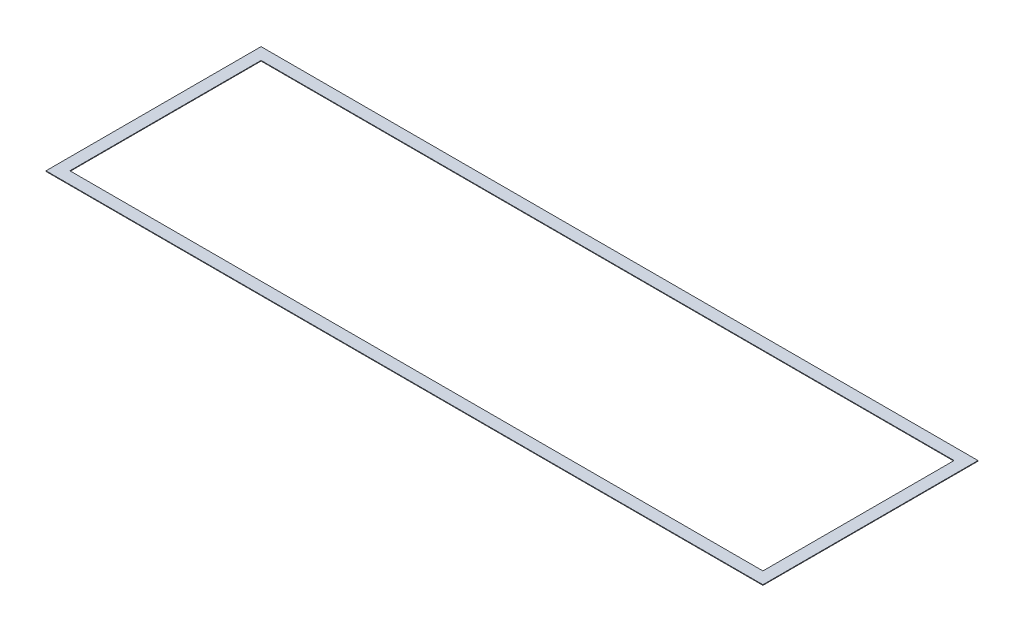
ISO-10303-21;
HEADER;
FILE_DESCRIPTION(('STEP AP214'),'2;1');
FILE_NAME('part.step','',(''),(''),'','','');
FILE_SCHEMA(('AUTOMOTIVE_DESIGN { 1 0 10303 214 1 1 1 1 }'));
ENDSEC;
DATA;
#1=APPLICATION_CONTEXT('core data for automotive mechanical design processes');
#2=APPLICATION_PROTOCOL_DEFINITION('international standard','automotive_design',2000,#1);
#3=PRODUCT_CONTEXT('',#1,'mechanical');
#4=PRODUCT('Part','Part','',(#3));
#5=PRODUCT_RELATED_PRODUCT_CATEGORY('part','',(#4));
#6=PRODUCT_DEFINITION_FORMATION('','',#4);
#7=PRODUCT_DEFINITION_CONTEXT('part definition',#1,'design');
#8=PRODUCT_DEFINITION('design','',#6,#7);
#9=PRODUCT_DEFINITION_SHAPE('','',#8);
#10=(LENGTH_UNIT() NAMED_UNIT(*) SI_UNIT(.MILLI.,.METRE.));
#11=(NAMED_UNIT(*) PLANE_ANGLE_UNIT() SI_UNIT($,.RADIAN.));
#12=(NAMED_UNIT(*) SI_UNIT($,.STERADIAN.) SOLID_ANGLE_UNIT());
#13=UNCERTAINTY_MEASURE_WITH_UNIT(LENGTH_MEASURE(1.E-05),#10,'distance_accuracy_value','');
#14=(GEOMETRIC_REPRESENTATION_CONTEXT(3) GLOBAL_UNCERTAINTY_ASSIGNED_CONTEXT((#13)) GLOBAL_UNIT_ASSIGNED_CONTEXT((#10,
#11,#12)) REPRESENTATION_CONTEXT('',''));
#15=CARTESIAN_POINT('',(0.,0.,0.));
#16=DIRECTION('',(0.,0.,1.));
#17=DIRECTION('',(1.,0.,0.));
#18=AXIS2_PLACEMENT_3D('',#15,#16,#17);
#19=CARTESIAN_POINT('',(0.,0.,0.));
#20=DIRECTION('',(0.,1.,0.));
#21=DIRECTION('',(0.,0.,1.));
#22=AXIS2_PLACEMENT_3D('',#19,#20,#21);
#23=PLANE('',#22);
#24=DIRECTION('',(-1.,0.,0.));
#25=VECTOR('',#24,1.);
#26=CARTESIAN_POINT('',(1473.2,0.,406.4));
#27=LINE('',#26,#25);
#28=CARTESIAN_POINT('',(1473.2,0.,406.4));
#29=VERTEX_POINT('',#28);
#30=CARTESIAN_POINT('',(-1473.2,0.,406.4));
#31=VERTEX_POINT('',#30);
#32=EDGE_CURVE('E109',#29,#31,#27,.T.);
#33=ORIENTED_EDGE('',*,*,#32,.F.);
#34=DIRECTION('',(0.,0.,1.));
#35=VECTOR('',#34,1.);
#36=CARTESIAN_POINT('',(1473.2,0.,406.4));
#37=LINE('',#36,#35);
#38=CARTESIAN_POINT('',(1473.2,0.,-406.4));
#39=VERTEX_POINT('',#38);
#40=EDGE_CURVE('E123',#39,#29,#37,.T.);
#41=ORIENTED_EDGE('',*,*,#40,.F.);
#42=DIRECTION('',(1.,0.,0.));
#43=VECTOR('',#42,1.);
#44=CARTESIAN_POINT('',(1473.2,0.,-406.4));
#45=LINE('',#44,#43);
#46=CARTESIAN_POINT('',(-1473.2,0.,-406.4));
#47=VERTEX_POINT('',#46);
#48=EDGE_CURVE('E118',#47,#39,#45,.T.);
#49=ORIENTED_EDGE('',*,*,#48,.F.);
#50=DIRECTION('',(0.,0.,-1.));
#51=VECTOR('',#50,1.);
#52=CARTESIAN_POINT('',(-1473.2,0.,406.4));
#53=LINE('',#52,#51);
#54=EDGE_CURVE('E112',#31,#47,#53,.T.);
#55=ORIENTED_EDGE('',*,*,#54,.F.);
#56=EDGE_LOOP('',(#33,#41,#49,#55));
#57=FACE_BOUND('',#56,.T.);
#58=DIRECTION('',(-1.,0.,0.));
#59=VECTOR('',#58,1.);
#60=CARTESIAN_POINT('',(1524.,0.,457.2));
#61=LINE('',#60,#59);
#62=CARTESIAN_POINT('',(1524.,0.,457.2));
#63=VERTEX_POINT('',#62);
#64=CARTESIAN_POINT('',(-1524.,0.,457.2));
#65=VERTEX_POINT('',#64);
#66=EDGE_CURVE('E107',#63,#65,#61,.T.);
#67=ORIENTED_EDGE('',*,*,#66,.T.);
#68=DIRECTION('',(0.,0.,-1.));
#69=VECTOR('',#68,1.);
#70=CARTESIAN_POINT('',(-1524.,0.,457.2));
#71=LINE('',#70,#69);
#72=CARTESIAN_POINT('',(-1524.,0.,-457.2));
#73=VERTEX_POINT('',#72);
#74=EDGE_CURVE('E93',#65,#73,#71,.T.);
#75=ORIENTED_EDGE('',*,*,#74,.T.);
#76=DIRECTION('',(1.,0.,0.));
#77=VECTOR('',#76,1.);
#78=CARTESIAN_POINT('',(1524.,0.,-457.2));
#79=LINE('',#78,#77);
#80=CARTESIAN_POINT('',(1524.,0.,-457.2));
#81=VERTEX_POINT('',#80);
#82=EDGE_CURVE('E80',#73,#81,#79,.T.);
#83=ORIENTED_EDGE('',*,*,#82,.T.);
#84=DIRECTION('',(0.,0.,1.));
#85=VECTOR('',#84,1.);
#86=CARTESIAN_POINT('',(1524.,0.,457.2));
#87=LINE('',#86,#85);
#88=EDGE_CURVE('E20',#81,#63,#87,.T.);
#89=ORIENTED_EDGE('',*,*,#88,.T.);
#90=EDGE_LOOP('',(#67,#75,#83,#89));
#91=FACE_BOUND('',#90,.T.);
#92=ADVANCED_FACE('F17',(#57,#91),#23,.F.);
#93=CARTESIAN_POINT('',(1524.,2.54,457.2));
#94=DIRECTION('',(-1.,0.,0.));
#95=DIRECTION('',(0.,0.,1.));
#96=AXIS2_PLACEMENT_3D('',#93,#94,#95);
#97=PLANE('',#96);
#98=DIRECTION('',(0.,1.,0.));
#99=VECTOR('',#98,1.);
#100=CARTESIAN_POINT('',(1524.,2.54,-457.2));
#101=LINE('',#100,#99);
#102=CARTESIAN_POINT('',(1524.,2.54,-457.2));
#103=VERTEX_POINT('',#102);
#104=EDGE_CURVE('E86',#81,#103,#101,.T.);
#105=ORIENTED_EDGE('',*,*,#104,.T.);
#106=DIRECTION('',(0.,0.,1.));
#107=VECTOR('',#106,1.);
#108=CARTESIAN_POINT('',(1524.,2.54,0.));
#109=LINE('',#108,#107);
#110=CARTESIAN_POINT('',(1524.,2.54,457.2));
#111=VERTEX_POINT('',#110);
#112=EDGE_CURVE('E130',#111,#103,#109,.F.);
#113=ORIENTED_EDGE('',*,*,#112,.F.);
#114=DIRECTION('',(0.,1.,0.));
#115=VECTOR('',#114,1.);
#116=CARTESIAN_POINT('',(1524.,2.54,457.2));
#117=LINE('',#116,#115);
#118=EDGE_CURVE('E89',#111,#63,#117,.F.);
#119=ORIENTED_EDGE('',*,*,#118,.T.);
#120=ORIENTED_EDGE('',*,*,#88,.F.);
#121=EDGE_LOOP('',(#105,#113,#119,#120));
#122=FACE_BOUND('',#121,.T.);
#123=ADVANCED_FACE('F85',(#122),#97,.F.);
#124=CARTESIAN_POINT('',(1524.,2.54,-457.2));
#125=DIRECTION('',(0.,0.,1.));
#126=DIRECTION('',(1.,0.,0.));
#127=AXIS2_PLACEMENT_3D('',#124,#125,#126);
#128=PLANE('',#127);
#129=DIRECTION('',(0.,1.,0.));
#130=VECTOR('',#129,1.);
#131=CARTESIAN_POINT('',(-1524.,2.54,-457.2));
#132=LINE('',#131,#130);
#133=CARTESIAN_POINT('',(-1524.,2.54,-457.2));
#134=VERTEX_POINT('',#133);
#135=EDGE_CURVE('E95',#73,#134,#132,.T.);
#136=ORIENTED_EDGE('',*,*,#135,.T.);
#137=DIRECTION('',(1.,0.,0.));
#138=VECTOR('',#137,1.);
#139=CARTESIAN_POINT('',(0.,2.54,-457.2));
#140=LINE('',#139,#138);
#141=EDGE_CURVE('E99',#103,#134,#140,.F.);
#142=ORIENTED_EDGE('',*,*,#141,.F.);
#143=ORIENTED_EDGE('',*,*,#104,.F.);
#144=ORIENTED_EDGE('',*,*,#82,.F.);
#145=EDGE_LOOP('',(#136,#142,#143,#144));
#146=FACE_BOUND('',#145,.T.);
#147=ADVANCED_FACE('F97',(#146),#128,.F.);
#148=CARTESIAN_POINT('',(-1524.,2.54,457.2));
#149=DIRECTION('',(1.,0.,0.));
#150=DIRECTION('',(0.,0.,-1.));
#151=AXIS2_PLACEMENT_3D('',#148,#149,#150);
#152=PLANE('',#151);
#153=DIRECTION('',(0.,1.,0.));
#154=VECTOR('',#153,1.);
#155=CARTESIAN_POINT('',(-1524.,2.54,457.2));
#156=LINE('',#155,#154);
#157=CARTESIAN_POINT('',(-1524.,2.54,457.2));
#158=VERTEX_POINT('',#157);
#159=EDGE_CURVE('E104',#65,#158,#156,.T.);
#160=ORIENTED_EDGE('',*,*,#159,.T.);
#161=DIRECTION('',(0.,0.,1.));
#162=VECTOR('',#161,1.);
#163=CARTESIAN_POINT('',(-1524.,2.54,0.));
#164=LINE('',#163,#162);
#165=EDGE_CURVE('E133',#134,#158,#164,.T.);
#166=ORIENTED_EDGE('',*,*,#165,.F.);
#167=ORIENTED_EDGE('',*,*,#135,.F.);
#168=ORIENTED_EDGE('',*,*,#74,.F.);
#169=EDGE_LOOP('',(#160,#166,#167,#168));
#170=FACE_BOUND('',#169,.T.);
#171=ADVANCED_FACE('F176',(#170),#152,.F.);
#172=CARTESIAN_POINT('',(1524.,2.54,457.2));
#173=DIRECTION('',(0.,0.,-1.));
#174=DIRECTION('',(-1.,0.,0.));
#175=AXIS2_PLACEMENT_3D('',#172,#173,#174);
#176=PLANE('',#175);
#177=ORIENTED_EDGE('',*,*,#118,.F.);
#178=DIRECTION('',(1.,0.,0.));
#179=VECTOR('',#178,1.);
#180=CARTESIAN_POINT('',(0.,2.54,457.2));
#181=LINE('',#180,#179);
#182=EDGE_CURVE('E136',#158,#111,#181,.T.);
#183=ORIENTED_EDGE('',*,*,#182,.F.);
#184=ORIENTED_EDGE('',*,*,#159,.F.);
#185=ORIENTED_EDGE('',*,*,#66,.F.);
#186=EDGE_LOOP('',(#177,#183,#184,#185));
#187=FACE_BOUND('',#186,.T.);
#188=ADVANCED_FACE('F173',(#187),#176,.F.);
#189=CARTESIAN_POINT('',(1473.2,2.54,406.4));
#190=DIRECTION('',(0.,0.,-1.));
#191=DIRECTION('',(-1.,0.,0.));
#192=AXIS2_PLACEMENT_3D('',#189,#190,#191);
#193=PLANE('',#192);
#194=DIRECTION('',(1.,0.,0.));
#195=VECTOR('',#194,1.);
#196=CARTESIAN_POINT('',(0.,2.54,406.4));
#197=LINE('',#196,#195);
#198=CARTESIAN_POINT('',(1473.2,2.54,406.4));
#199=VERTEX_POINT('',#198);
#200=CARTESIAN_POINT('',(-1473.2,2.54,406.4));
#201=VERTEX_POINT('',#200);
#202=EDGE_CURVE('E139',#199,#201,#197,.F.);
#203=ORIENTED_EDGE('',*,*,#202,.F.);
#204=DIRECTION('',(0.,1.,0.));
#205=VECTOR('',#204,1.);
#206=CARTESIAN_POINT('',(1473.2,2.54,406.4));
#207=LINE('',#206,#205);
#208=EDGE_CURVE('E126',#29,#199,#207,.T.);
#209=ORIENTED_EDGE('',*,*,#208,.F.);
#210=ORIENTED_EDGE('',*,*,#32,.T.);
#211=DIRECTION('',(0.,1.,0.));
#212=VECTOR('',#211,1.);
#213=CARTESIAN_POINT('',(-1473.2,2.54,406.4));
#214=LINE('',#213,#212);
#215=EDGE_CURVE('E115',#201,#31,#214,.F.);
#216=ORIENTED_EDGE('',*,*,#215,.F.);
#217=EDGE_LOOP('',(#203,#209,#210,#216));
#218=FACE_BOUND('',#217,.T.);
#219=ADVANCED_FACE('F156',(#218),#193,.T.);
#220=CARTESIAN_POINT('',(-1473.2,2.54,406.4));
#221=DIRECTION('',(1.,0.,0.));
#222=DIRECTION('',(0.,0.,-1.));
#223=AXIS2_PLACEMENT_3D('',#220,#221,#222);
#224=PLANE('',#223);
#225=DIRECTION('',(0.,0.,1.));
#226=VECTOR('',#225,1.);
#227=CARTESIAN_POINT('',(-1473.2,2.54,0.));
#228=LINE('',#227,#226);
#229=CARTESIAN_POINT('',(-1473.2,2.54,-406.4));
#230=VERTEX_POINT('',#229);
#231=EDGE_CURVE('E142',#201,#230,#228,.F.);
#232=ORIENTED_EDGE('',*,*,#231,.F.);
#233=ORIENTED_EDGE('',*,*,#215,.T.);
#234=ORIENTED_EDGE('',*,*,#54,.T.);
#235=DIRECTION('',(0.,1.,0.));
#236=VECTOR('',#235,1.);
#237=CARTESIAN_POINT('',(-1473.2,2.54,-406.4));
#238=LINE('',#237,#236);
#239=EDGE_CURVE('E120',#230,#47,#238,.F.);
#240=ORIENTED_EDGE('',*,*,#239,.F.);
#241=EDGE_LOOP('',(#232,#233,#234,#240));
#242=FACE_BOUND('',#241,.T.);
#243=ADVANCED_FACE('F152',(#242),#224,.T.);
#244=CARTESIAN_POINT('',(1473.2,2.54,-406.4));
#245=DIRECTION('',(0.,0.,1.));
#246=DIRECTION('',(1.,0.,0.));
#247=AXIS2_PLACEMENT_3D('',#244,#245,#246);
#248=PLANE('',#247);
#249=DIRECTION('',(1.,0.,0.));
#250=VECTOR('',#249,1.);
#251=CARTESIAN_POINT('',(0.,2.54,-406.4));
#252=LINE('',#251,#250);
#253=CARTESIAN_POINT('',(1473.2,2.54,-406.4));
#254=VERTEX_POINT('',#253);
#255=EDGE_CURVE('E26',#230,#254,#252,.T.);
#256=ORIENTED_EDGE('',*,*,#255,.F.);
#257=ORIENTED_EDGE('',*,*,#239,.T.);
#258=ORIENTED_EDGE('',*,*,#48,.T.);
#259=DIRECTION('',(0.,1.,0.));
#260=VECTOR('',#259,1.);
#261=CARTESIAN_POINT('',(1473.2,2.54,-406.4));
#262=LINE('',#261,#260);
#263=EDGE_CURVE('E35',#254,#39,#262,.F.);
#264=ORIENTED_EDGE('',*,*,#263,.F.);
#265=EDGE_LOOP('',(#256,#257,#258,#264));
#266=FACE_BOUND('',#265,.T.);
#267=ADVANCED_FACE('F150',(#266),#248,.T.);
#268=CARTESIAN_POINT('',(1473.2,2.54,406.4));
#269=DIRECTION('',(-1.,0.,0.));
#270=DIRECTION('',(0.,0.,1.));
#271=AXIS2_PLACEMENT_3D('',#268,#269,#270);
#272=PLANE('',#271);
#273=DIRECTION('',(0.,0.,1.));
#274=VECTOR('',#273,1.);
#275=CARTESIAN_POINT('',(1473.2,2.54,0.));
#276=LINE('',#275,#274);
#277=EDGE_CURVE('E11',#254,#199,#276,.T.);
#278=ORIENTED_EDGE('',*,*,#277,.F.);
#279=ORIENTED_EDGE('',*,*,#263,.T.);
#280=ORIENTED_EDGE('',*,*,#40,.T.);
#281=ORIENTED_EDGE('',*,*,#208,.T.);
#282=EDGE_LOOP('',(#278,#279,#280,#281));
#283=FACE_BOUND('',#282,.T.);
#284=ADVANCED_FACE('F158',(#283),#272,.T.);
#285=CARTESIAN_POINT('',(0.,2.54,0.));
#286=DIRECTION('',(0.,1.,0.));
#287=DIRECTION('',(0.,0.,1.));
#288=AXIS2_PLACEMENT_3D('',#285,#286,#287);
#289=PLANE('',#288);
#290=ORIENTED_EDGE('',*,*,#255,.T.);
#291=ORIENTED_EDGE('',*,*,#277,.T.);
#292=ORIENTED_EDGE('',*,*,#202,.T.);
#293=ORIENTED_EDGE('',*,*,#231,.T.);
#294=EDGE_LOOP('',(#290,#291,#292,#293));
#295=FACE_BOUND('',#294,.T.);
#296=ORIENTED_EDGE('',*,*,#165,.T.);
#297=ORIENTED_EDGE('',*,*,#182,.T.);
#298=ORIENTED_EDGE('',*,*,#112,.T.);
#299=ORIENTED_EDGE('',*,*,#141,.T.);
#300=EDGE_LOOP('',(#296,#297,#298,#299));
#301=FACE_BOUND('',#300,.T.);
#302=ADVANCED_FACE('F147',(#295,#301),#289,.T.);
#303=CLOSED_SHELL('',(#92,#123,#147,#171,#188,#219,#243,#267,#284,#302));
#304=MANIFOLD_SOLID_BREP('B1',#303);
#305=ADVANCED_BREP_SHAPE_REPRESENTATION('',(#18,#304),#14);
#306=SHAPE_DEFINITION_REPRESENTATION(#9,#305);
ENDSEC;
END-ISO-10303-21;
